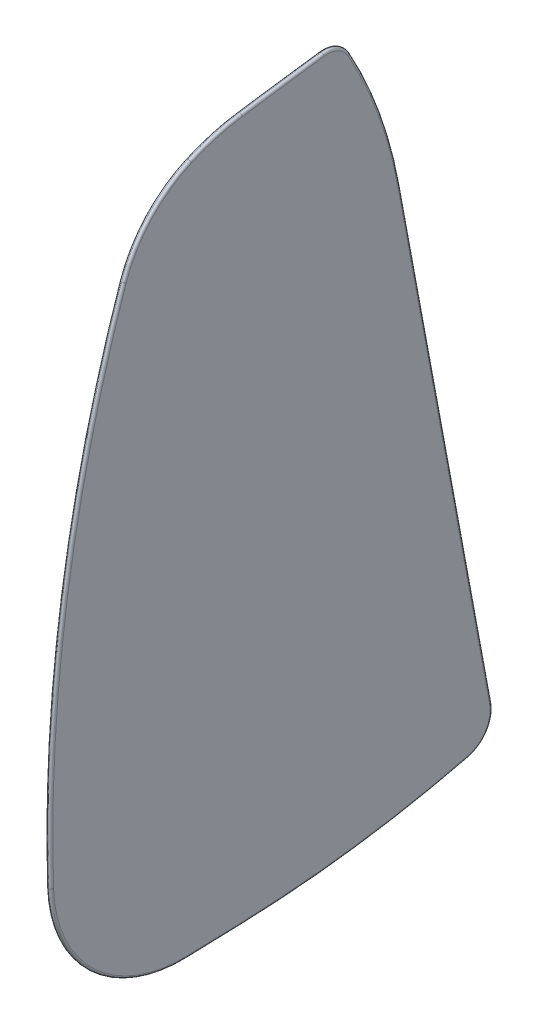
ISO-10303-21;
HEADER;
FILE_DESCRIPTION(('STEP AP214'),'2;1');
FILE_NAME('part.step','',(''),(''),'','','');
FILE_SCHEMA(('AUTOMOTIVE_DESIGN { 1 0 10303 214 1 1 1 1 }'));
ENDSEC;
DATA;
#1=APPLICATION_CONTEXT('core data for automotive mechanical design processes');
#2=APPLICATION_PROTOCOL_DEFINITION('international standard','automotive_design',2000,#1);
#3=PRODUCT_CONTEXT('',#1,'mechanical');
#4=PRODUCT('Part','Part','',(#3));
#5=PRODUCT_RELATED_PRODUCT_CATEGORY('part','',(#4));
#6=PRODUCT_DEFINITION_FORMATION('','',#4);
#7=PRODUCT_DEFINITION_CONTEXT('part definition',#1,'design');
#8=PRODUCT_DEFINITION('design','',#6,#7);
#9=PRODUCT_DEFINITION_SHAPE('','',#8);
#10=(LENGTH_UNIT() NAMED_UNIT(*) SI_UNIT(.MILLI.,.METRE.));
#11=(NAMED_UNIT(*) PLANE_ANGLE_UNIT() SI_UNIT($,.RADIAN.));
#12=(NAMED_UNIT(*) SI_UNIT($,.STERADIAN.) SOLID_ANGLE_UNIT());
#13=UNCERTAINTY_MEASURE_WITH_UNIT(LENGTH_MEASURE(1.E-05),#10,'distance_accuracy_value','');
#14=(GEOMETRIC_REPRESENTATION_CONTEXT(3) GLOBAL_UNCERTAINTY_ASSIGNED_CONTEXT((#13)) GLOBAL_UNIT_ASSIGNED_CONTEXT((#10,
#11,#12)) REPRESENTATION_CONTEXT('',''));
#15=CARTESIAN_POINT('',(0.,0.,0.));
#16=DIRECTION('',(0.,0.,1.));
#17=DIRECTION('',(1.,0.,0.));
#18=AXIS2_PLACEMENT_3D('',#15,#16,#17);
#19=CARTESIAN_POINT('',(1.5875,-2463.06089879731,-387.550646837047));
#20=DIRECTION('',(-1.,0.,0.));
#21=DIRECTION('',(0.,0.,1.));
#22=AXIS2_PLACEMENT_3D('',#19,#20,#21);
#23=PLANE('',#22);
#24=CARTESIAN_POINT('',(1.5875,165.367676868495,-9.10431464140729));
#25=DIRECTION('',(-1.,0.,0.));
#26=DIRECTION('',(0.,0.,1.));
#27=AXIS2_PLACEMENT_3D('',#24,#25,#26);
#28=CIRCLE('',#27,63.0906395932081);
#29=CARTESIAN_POINT('',(1.5875,227.814351787574,-0.113119179703479));
#30=VERTEX_POINT('',#29);
#31=CARTESIAN_POINT('',(1.5875,223.057286400209,16.4365889518184));
#32=VERTEX_POINT('',#31);
#33=EDGE_CURVE('E43',#30,#32,#28,.F.);
#34=ORIENTED_EDGE('',*,*,#33,.T.);
#35=CARTESIAN_POINT('',(1.5875,187.192136164159,0.558021702512013));
#36=DIRECTION('',(-1.,0.,0.));
#37=DIRECTION('',(0.,0.,1.));
#38=AXIS2_PLACEMENT_3D('',#35,#36,#37);
#39=CIRCLE('',#38,39.222925685693);
#40=CARTESIAN_POINT('',(1.5875,199.852299131577,37.6815745091042));
#41=VERTEX_POINT('',#40);
#42=EDGE_CURVE('E11',#32,#41,#39,.F.);
#43=ORIENTED_EDGE('',*,*,#42,.T.);
#44=CARTESIAN_POINT('',(1.5875,55.6857042225575,-385.059918851711));
#45=DIRECTION('',(-1.,0.,0.));
#46=DIRECTION('',(0.,0.,1.));
#47=AXIS2_PLACEMENT_3D('',#44,#45,#46);
#48=CIRCLE('',#47,446.647934391947);
#49=CARTESIAN_POINT('',(1.5875,40.9104577830131,61.3435638735519));
#50=VERTEX_POINT('',#49);
#51=EDGE_CURVE('E293',#41,#50,#48,.F.);
#52=ORIENTED_EDGE('',*,*,#51,.T.);
#53=CARTESIAN_POINT('',(1.5875,42.3031533449836,19.2661506968832));
#54=DIRECTION('',(-1.,0.,0.));
#55=DIRECTION('',(0.,0.,1.));
#56=AXIS2_PLACEMENT_3D('',#53,#54,#55);
#57=CIRCLE('',#56,42.1004548736683);
#58=CARTESIAN_POINT('',(1.5875,0.223974446046652,17.927866810317));
#59=VERTEX_POINT('',#58);
#60=EDGE_CURVE('E295',#50,#59,#57,.F.);
#61=ORIENTED_EDGE('',*,*,#60,.T.);
#62=DIRECTION('',(0.,0.0317878723776747,-0.999494637889419));
#63=VECTOR('',#62,1.);
#64=CARTESIAN_POINT('',(1.5875,10.6176873417101,-308.877909416845));
#65=LINE('',#64,#63);
#66=CARTESIAN_POINT('',(1.5875,0.793348868824694,0.025231623699778));
#67=VERTEX_POINT('',#66);
#68=EDGE_CURVE('E297',#59,#67,#65,.T.);
#69=ORIENTED_EDGE('',*,*,#68,.T.);
#70=CARTESIAN_POINT('',(1.5875,355.044088675088,11.29180262846));
#71=DIRECTION('',(-1.,0.,0.));
#72=DIRECTION('',(0.,0.,1.));
#73=AXIS2_PLACEMENT_3D('',#70,#71,#72);
#74=CIRCLE('',#73,354.429855225954);
#75=CARTESIAN_POINT('',(1.5875,10.9134874562677,-73.5294893934341));
#76=VERTEX_POINT('',#75);
#77=EDGE_CURVE('E299',#67,#76,#74,.F.);
#78=ORIENTED_EDGE('',*,*,#77,.T.);
#79=CARTESIAN_POINT('',(1.5875,20.1614266157411,-71.2500578483515));
#80=DIRECTION('',(-1.,0.,0.));
#81=DIRECTION('',(0.,0.,1.));
#82=AXIS2_PLACEMENT_3D('',#79,#80,#81);
#83=CIRCLE('',#82,9.52471452937241);
#84=CARTESIAN_POINT('',(1.5875,21.9008605829964,-80.6145950146826));
#85=VERTEX_POINT('',#84);
#86=EDGE_CURVE('E301',#76,#85,#83,.F.);
#87=ORIENTED_EDGE('',*,*,#86,.T.);
#88=DIRECTION('',(0.,0.983182974928292,0.182623212684351));
#89=VECTOR('',#88,1.);
#90=CARTESIAN_POINT('',(1.5875,-2435.29534047942,-537.031229432634));
#91=LINE('',#90,#89);
#92=CARTESIAN_POINT('',(1.5875,182.940602095311,-50.7019584914747));
#93=VERTEX_POINT('',#92);
#94=EDGE_CURVE('E303',#85,#93,#91,.T.);
#95=ORIENTED_EDGE('',*,*,#94,.T.);
#96=CARTESIAN_POINT('',(1.5875,156.06262125118,94.0002005493551));
#97=DIRECTION('',(-1.,0.,0.));
#98=DIRECTION('',(0.,0.,1.));
#99=AXIS2_PLACEMENT_3D('',#96,#97,#98);
#100=CIRCLE('',#99,147.177242416533);
#101=CARTESIAN_POINT('',(1.5875,227.56221835922,-34.6425151352997));
#102=VERTEX_POINT('',#101);
#103=EDGE_CURVE('E161',#93,#102,#100,.F.);
#104=ORIENTED_EDGE('',*,*,#103,.T.);
#105=CARTESIAN_POINT('',(1.5875,223.760356708439,-27.8021715921775));
#106=DIRECTION('',(-1.,0.,0.));
#107=DIRECTION('',(0.,0.,1.));
#108=AXIS2_PLACEMENT_3D('',#105,#106,#107);
#109=CIRCLE('',#108,7.82588345170112);
#110=CARTESIAN_POINT('',(1.5875,231.517020123578,-26.7636031236328));
#111=VERTEX_POINT('',#110);
#112=EDGE_CURVE('E155',#102,#111,#109,.F.);
#113=ORIENTED_EDGE('',*,*,#112,.T.);
#114=CARTESIAN_POINT('',(1.5875,-2463.06089879731,-387.550646837047));
#115=DIRECTION('',(-1.,0.,0.));
#116=DIRECTION('',(0.,0.,1.));
#117=AXIS2_PLACEMENT_3D('',#114,#115,#116);
#118=CIRCLE('',#117,2718.62418367223);
#119=EDGE_CURVE('E158',#111,#30,#118,.F.);
#120=ORIENTED_EDGE('',*,*,#119,.T.);
#121=EDGE_LOOP('',(#34,#43,#52,#61,#69,#78,#87,#95,#104,#113,#120));
#122=FACE_BOUND('',#121,.T.);
#123=ADVANCED_FACE('F33',(#122),#23,.F.);
#124=CARTESIAN_POINT('',(0.,-2463.06089879731,-387.550646837047));
#125=DIRECTION('',(-1.,0.,0.));
#126=DIRECTION('',(0.,0.,1.));
#127=AXIS2_PLACEMENT_3D('',#124,#125,#126);
#128=PLANE('',#127);
#129=CARTESIAN_POINT('',(0.,187.192136164159,0.558021702512013));
#130=DIRECTION('',(-1.,0.,0.));
#131=DIRECTION('',(0.,0.,1.));
#132=AXIS2_PLACEMENT_3D('',#129,#130,#131);
#133=CIRCLE('',#132,39.222925685693);
#134=CARTESIAN_POINT('',(0.,199.852299131576,37.6815745091041));
#135=VERTEX_POINT('',#134);
#136=CARTESIAN_POINT('',(0.,223.057286400211,16.4365889518193));
#137=VERTEX_POINT('',#136);
#138=EDGE_CURVE('E266',#135,#137,#133,.T.);
#139=ORIENTED_EDGE('',*,*,#138,.T.);
#140=CARTESIAN_POINT('',(0.,165.367676868495,-9.10431464140729));
#141=DIRECTION('',(-1.,0.,0.));
#142=DIRECTION('',(0.,0.,1.));
#143=AXIS2_PLACEMENT_3D('',#140,#141,#142);
#144=CIRCLE('',#143,63.0906395932081);
#145=CARTESIAN_POINT('',(0.,227.814351787574,-0.113119179703479));
#146=VERTEX_POINT('',#145);
#147=EDGE_CURVE('E291',#137,#146,#144,.T.);
#148=ORIENTED_EDGE('',*,*,#147,.T.);
#149=CARTESIAN_POINT('',(0.,-2463.06089879731,-387.550646837047));
#150=DIRECTION('',(-1.,0.,0.));
#151=DIRECTION('',(0.,0.,1.));
#152=AXIS2_PLACEMENT_3D('',#149,#150,#151);
#153=CIRCLE('',#152,2718.62418367223);
#154=CARTESIAN_POINT('',(0.,231.517020123578,-26.7636031236328));
#155=VERTEX_POINT('',#154);
#156=EDGE_CURVE('E289',#146,#155,#153,.T.);
#157=ORIENTED_EDGE('',*,*,#156,.T.);
#158=CARTESIAN_POINT('',(0.,223.760356708439,-27.8021715921775));
#159=DIRECTION('',(-1.,0.,0.));
#160=DIRECTION('',(0.,0.,1.));
#161=AXIS2_PLACEMENT_3D('',#158,#159,#160);
#162=CIRCLE('',#161,7.82588345170112);
#163=CARTESIAN_POINT('',(0.,227.56221835922,-34.6425151352997));
#164=VERTEX_POINT('',#163);
#165=EDGE_CURVE('E287',#155,#164,#162,.T.);
#166=ORIENTED_EDGE('',*,*,#165,.T.);
#167=CARTESIAN_POINT('',(0.,156.06262125118,94.0002005493551));
#168=DIRECTION('',(-1.,0.,0.));
#169=DIRECTION('',(0.,0.,1.));
#170=AXIS2_PLACEMENT_3D('',#167,#168,#169);
#171=CIRCLE('',#170,147.177242416533);
#172=CARTESIAN_POINT('',(0.,182.940602095311,-50.7019584914747));
#173=VERTEX_POINT('',#172);
#174=EDGE_CURVE('E285',#164,#173,#171,.T.);
#175=ORIENTED_EDGE('',*,*,#174,.T.);
#176=DIRECTION('',(0.,0.983182974928292,0.182623212684351));
#177=VECTOR('',#176,1.);
#178=CARTESIAN_POINT('',(0.,21.9008605829963,-80.6145950146826));
#179=LINE('',#178,#177);
#180=CARTESIAN_POINT('',(0.,21.9008605829964,-80.6145950146826));
#181=VERTEX_POINT('',#180);
#182=EDGE_CURVE('E283',#173,#181,#179,.F.);
#183=ORIENTED_EDGE('',*,*,#182,.T.);
#184=CARTESIAN_POINT('',(0.,20.1614266157411,-71.2500578483515));
#185=DIRECTION('',(-1.,0.,0.));
#186=DIRECTION('',(0.,0.,1.));
#187=AXIS2_PLACEMENT_3D('',#184,#185,#186);
#188=CIRCLE('',#187,9.52471452937241);
#189=CARTESIAN_POINT('',(0.,10.9134874562677,-73.5294893934341));
#190=VERTEX_POINT('',#189);
#191=EDGE_CURVE('E281',#181,#190,#188,.T.);
#192=ORIENTED_EDGE('',*,*,#191,.T.);
#193=CARTESIAN_POINT('',(0.,355.044088675088,11.29180262846));
#194=DIRECTION('',(-1.,0.,0.));
#195=DIRECTION('',(0.,0.,1.));
#196=AXIS2_PLACEMENT_3D('',#193,#194,#195);
#197=CIRCLE('',#196,354.429855225954);
#198=CARTESIAN_POINT('',(0.,0.793348868824726,0.025231623699779));
#199=VERTEX_POINT('',#198);
#200=EDGE_CURVE('E279',#190,#199,#197,.T.);
#201=ORIENTED_EDGE('',*,*,#200,.T.);
#202=DIRECTION('',(0.,0.0317878723776747,-0.999494637889419));
#203=VECTOR('',#202,1.);
#204=CARTESIAN_POINT('',(0.,0.223974446028472,17.9278668103165));
#205=LINE('',#204,#203);
#206=CARTESIAN_POINT('',(0.,0.22397444604665,17.927866810317));
#207=VERTEX_POINT('',#206);
#208=EDGE_CURVE('E277',#199,#207,#205,.F.);
#209=ORIENTED_EDGE('',*,*,#208,.T.);
#210=CARTESIAN_POINT('',(0.,42.3031533449836,19.2661506968832));
#211=DIRECTION('',(-1.,0.,0.));
#212=DIRECTION('',(0.,0.,1.));
#213=AXIS2_PLACEMENT_3D('',#210,#211,#212);
#214=CIRCLE('',#213,42.1004548736683);
#215=CARTESIAN_POINT('',(0.,40.9104577830131,61.3435638735519));
#216=VERTEX_POINT('',#215);
#217=EDGE_CURVE('E273',#207,#216,#214,.T.);
#218=ORIENTED_EDGE('',*,*,#217,.T.);
#219=CARTESIAN_POINT('',(0.,55.6857042225575,-385.059918851711));
#220=DIRECTION('',(-1.,0.,0.));
#221=DIRECTION('',(0.,0.,1.));
#222=AXIS2_PLACEMENT_3D('',#219,#220,#221);
#223=CIRCLE('',#222,446.647934391947);
#224=EDGE_CURVE('E100',#216,#135,#223,.T.);
#225=ORIENTED_EDGE('',*,*,#224,.T.);
#226=EDGE_LOOP('',(#139,#148,#157,#166,#175,#183,#192,#201,#209,#218,#225));
#227=FACE_BOUND('',#226,.T.);
#228=ADVANCED_FACE('F361',(#227),#128,.T.);
#229=CARTESIAN_POINT('',(0.79375,20.1614266157411,-71.2500578483515));
#230=DIRECTION('',(-1.,0.,0.));
#231=DIRECTION('',(0.,0.,1.));
#232=AXIS2_PLACEMENT_3D('',#229,#230,#231);
#233=TOROIDAL_SURFACE('',#232,9.52471452937241,0.79375);
#234=CARTESIAN_POINT('',(0.79375,21.9008605829964,-80.6145950146826));
#235=DIRECTION('',(0.,0.983182974928292,0.18262321268435));
#236=DIRECTION('',(0.,-0.18262321268435,0.983182974928292));
#237=AXIS2_PLACEMENT_3D('',#234,#235,#236);
#238=CIRCLE('',#237,0.79375);
#239=CARTESIAN_POINT('',(0.79375,22.0458177580646,-81.3949965010319));
#240=VERTEX_POINT('',#239);
#241=EDGE_CURVE('E261',#85,#240,#238,.T.);
#242=ORIENTED_EDGE('',*,*,#241,.F.);
#243=ORIENTED_EDGE('',*,*,#86,.F.);
#244=CARTESIAN_POINT('',(0.79375,10.9134874562677,-73.5294893934341));
#245=DIRECTION('',(0.,-0.23931757094171,0.970941347476025));
#246=DIRECTION('',(0.,-0.970941347476025,-0.23931757094171));
#247=AXIS2_PLACEMENT_3D('',#244,#245,#246);
#248=CIRCLE('',#247,0.79375);
#249=CARTESIAN_POINT('',(0.79375,10.1428027617086,-73.7194477153691));
#250=VERTEX_POINT('',#249);
#251=EDGE_CURVE('E37',#250,#76,#248,.T.);
#252=ORIENTED_EDGE('',*,*,#251,.F.);
#253=CARTESIAN_POINT('',(0.79375,20.1614266157411,-71.2500578483515));
#254=DIRECTION('',(-1.,0.,0.));
#255=DIRECTION('',(0.,0.,1.));
#256=AXIS2_PLACEMENT_3D('',#253,#254,#255);
#257=CIRCLE('',#256,10.3184645293724);
#258=EDGE_CURVE('E88',#240,#250,#257,.T.);
#259=ORIENTED_EDGE('',*,*,#258,.F.);
#260=EDGE_LOOP('',(#242,#243,#252,#259));
#261=FACE_BOUND('',#260,.T.);
#262=ADVANCED_FACE('F35',(#261),#233,.T.);
#263=CARTESIAN_POINT('',(0.79375,355.044088675088,11.29180262846));
#264=DIRECTION('',(-1.,0.,0.));
#265=DIRECTION('',(0.,0.,1.));
#266=AXIS2_PLACEMENT_3D('',#263,#264,#265);
#267=TOROIDAL_SURFACE('',#266,354.429855225954,0.79375);
#268=ORIENTED_EDGE('',*,*,#251,.T.);
#269=ORIENTED_EDGE('',*,*,#77,.F.);
#270=CARTESIAN_POINT('',(0.79375,0.793348868824726,0.025231623699779));
#271=DIRECTION('',(0.,-0.0317878723776744,0.999494637889419));
#272=DIRECTION('',(0.,-0.999494637889419,-0.0317878723776744));
#273=AXIS2_PLACEMENT_3D('',#270,#271,#272);
#274=CIRCLE('',#273,0.79375);
#275=CARTESIAN_POINT('',(0.79375,0.,0.));
#276=VERTEX_POINT('',#275);
#277=EDGE_CURVE('E258',#276,#67,#274,.T.);
#278=ORIENTED_EDGE('',*,*,#277,.F.);
#279=CARTESIAN_POINT('',(0.79375,355.044088675088,11.29180262846));
#280=DIRECTION('',(-1.,0.,0.));
#281=DIRECTION('',(0.,0.,1.));
#282=AXIS2_PLACEMENT_3D('',#279,#280,#281);
#283=CIRCLE('',#282,355.223605225954);
#284=EDGE_CURVE('E255',#250,#276,#283,.T.);
#285=ORIENTED_EDGE('',*,*,#284,.F.);
#286=EDGE_LOOP('',(#268,#269,#278,#285));
#287=FACE_BOUND('',#286,.T.);
#288=ADVANCED_FACE('F355',(#287),#267,.T.);
#289=CARTESIAN_POINT('',(0.79375,20.1614266157411,-71.2500578483515));
#290=DIRECTION('',(-1.,0.,0.));
#291=DIRECTION('',(0.,0.,1.));
#292=AXIS2_PLACEMENT_3D('',#289,#290,#291);
#293=TOROIDAL_SURFACE('',#292,9.52471452937241,0.79375);
#294=CARTESIAN_POINT('',(0.79375,21.9008605829964,-80.6145950146826));
#295=DIRECTION('',(0.,0.983182974928292,0.182623212684351));
#296=DIRECTION('',(0.,-0.182623212684351,0.983182974928292));
#297=AXIS2_PLACEMENT_3D('',#294,#295,#296);
#298=CIRCLE('',#297,0.79375);
#299=EDGE_CURVE('E249',#240,#181,#298,.T.);
#300=ORIENTED_EDGE('',*,*,#299,.F.);
#301=ORIENTED_EDGE('',*,*,#258,.T.);
#302=CARTESIAN_POINT('',(0.79375,10.9134874562677,-73.5294893934341));
#303=DIRECTION('',(0.,-0.23931757094171,0.970941347476025));
#304=DIRECTION('',(0.,-0.970941347476025,-0.23931757094171));
#305=AXIS2_PLACEMENT_3D('',#302,#303,#304);
#306=CIRCLE('',#305,0.79375);
#307=EDGE_CURVE('E252',#190,#250,#306,.T.);
#308=ORIENTED_EDGE('',*,*,#307,.F.);
#309=ORIENTED_EDGE('',*,*,#191,.F.);
#310=EDGE_LOOP('',(#300,#301,#308,#309));
#311=FACE_BOUND('',#310,.T.);
#312=ADVANCED_FACE('F357',(#311),#293,.T.);
#313=CARTESIAN_POINT('',(0.79375,-2435.29534047942,-537.031229432634));
#314=DIRECTION('',(0.,0.983182974928292,0.182623212684351));
#315=DIRECTION('',(0.,-0.182623212684351,0.983182974928292));
#316=AXIS2_PLACEMENT_3D('',#313,#314,#315);
#317=CYLINDRICAL_SURFACE('',#316,0.79375);
#318=ORIENTED_EDGE('',*,*,#94,.F.);
#319=ORIENTED_EDGE('',*,*,#241,.T.);
#320=DIRECTION('',(0.,0.983182974928292,0.182623212684351));
#321=VECTOR('',#320,1.);
#322=CARTESIAN_POINT('',(0.79375,183.085559270379,-51.482359977824));
#323=LINE('',#322,#321);
#324=CARTESIAN_POINT('',(0.79375,183.085559270379,-51.482359977824));
#325=VERTEX_POINT('',#324);
#326=EDGE_CURVE('E246',#325,#240,#323,.F.);
#327=ORIENTED_EDGE('',*,*,#326,.F.);
#328=CARTESIAN_POINT('',(0.79375,182.940602095311,-50.7019584914747));
#329=DIRECTION('',(0.,0.983182974928291,0.182623212684356));
#330=DIRECTION('',(0.,-0.182623212684356,0.983182974928291));
#331=AXIS2_PLACEMENT_3D('',#328,#329,#330);
#332=CIRCLE('',#331,0.79375);
#333=EDGE_CURVE('E243',#93,#325,#332,.T.);
#334=ORIENTED_EDGE('',*,*,#333,.F.);
#335=EDGE_LOOP('',(#318,#319,#327,#334));
#336=FACE_BOUND('',#335,.T.);
#337=ADVANCED_FACE('F307',(#336),#317,.T.);
#338=CARTESIAN_POINT('',(0.79375,10.6176873417101,-308.877909416845));
#339=DIRECTION('',(0.,0.0317878723776747,-0.999494637889419));
#340=DIRECTION('',(0.,0.999494637889419,0.0317878723776747));
#341=AXIS2_PLACEMENT_3D('',#338,#339,#340);
#342=CYLINDRICAL_SURFACE('',#341,0.79375);
#343=ORIENTED_EDGE('',*,*,#277,.T.);
#344=ORIENTED_EDGE('',*,*,#68,.F.);
#345=CARTESIAN_POINT('',(0.79375,0.223974446028472,17.9278668103165));
#346=DIRECTION('',(0.,-0.0317878723776754,0.999494637889419));
#347=DIRECTION('',(0.,-0.999494637889419,-0.0317878723776754));
#348=AXIS2_PLACEMENT_3D('',#345,#346,#347);
#349=CIRCLE('',#348,0.79375);
#350=CARTESIAN_POINT('',(0.79375,-0.569374422778077,17.9026351866173));
#351=VERTEX_POINT('',#350);
#352=EDGE_CURVE('E240',#351,#59,#349,.T.);
#353=ORIENTED_EDGE('',*,*,#352,.F.);
#354=DIRECTION('',(0.,0.0317878723776747,-0.999494637889419));
#355=VECTOR('',#354,1.);
#356=CARTESIAN_POINT('',(0.79375,-0.569374422796254,17.9026351866167));
#357=LINE('',#356,#355);
#358=EDGE_CURVE('E237',#276,#351,#357,.F.);
#359=ORIENTED_EDGE('',*,*,#358,.F.);
#360=EDGE_LOOP('',(#343,#344,#353,#359));
#361=FACE_BOUND('',#360,.T.);
#362=ADVANCED_FACE('F345',(#361),#342,.T.);
#363=CARTESIAN_POINT('',(0.79375,355.044088675088,11.29180262846));
#364=DIRECTION('',(-1.,0.,0.));
#365=DIRECTION('',(0.,0.,1.));
#366=AXIS2_PLACEMENT_3D('',#363,#364,#365);
#367=TOROIDAL_SURFACE('',#366,354.429855225954,0.79375);
#368=ORIENTED_EDGE('',*,*,#307,.T.);
#369=ORIENTED_EDGE('',*,*,#284,.T.);
#370=CARTESIAN_POINT('',(0.79375,0.793348868824726,0.025231623699779));
#371=DIRECTION('',(0.,-0.0317878723776744,0.999494637889419));
#372=DIRECTION('',(0.,-0.999494637889419,-0.0317878723776744));
#373=AXIS2_PLACEMENT_3D('',#370,#371,#372);
#374=CIRCLE('',#373,0.79375);
#375=EDGE_CURVE('E234',#199,#276,#374,.T.);
#376=ORIENTED_EDGE('',*,*,#375,.F.);
#377=ORIENTED_EDGE('',*,*,#200,.F.);
#378=EDGE_LOOP('',(#368,#369,#376,#377));
#379=FACE_BOUND('',#378,.T.);
#380=ADVANCED_FACE('F354',(#379),#367,.T.);
#381=CARTESIAN_POINT('',(0.79375,182.940602095311,-50.7019584914747));
#382=DIRECTION('',(0.,-0.983182974928292,-0.182623212684351));
#383=DIRECTION('',(0.,0.182623212684351,-0.983182974928292));
#384=AXIS2_PLACEMENT_3D('',#381,#382,#383);
#385=CYLINDRICAL_SURFACE('',#384,0.79375);
#386=ORIENTED_EDGE('',*,*,#299,.T.);
#387=ORIENTED_EDGE('',*,*,#182,.F.);
#388=CARTESIAN_POINT('',(0.79375,182.940602095311,-50.7019584914747));
#389=DIRECTION('',(0.,0.98318297492829,0.182623212684361));
#390=DIRECTION('',(0.,-0.182623212684361,0.98318297492829));
#391=AXIS2_PLACEMENT_3D('',#388,#389,#390);
#392=CIRCLE('',#391,0.79375);
#393=EDGE_CURVE('E231',#325,#173,#392,.T.);
#394=ORIENTED_EDGE('',*,*,#393,.F.);
#395=ORIENTED_EDGE('',*,*,#326,.T.);
#396=EDGE_LOOP('',(#386,#387,#394,#395));
#397=FACE_BOUND('',#396,.T.);
#398=ADVANCED_FACE('F360',(#397),#385,.T.);
#399=CARTESIAN_POINT('',(0.79375,156.06262125118,94.0002005493551));
#400=DIRECTION('',(-1.,0.,0.));
#401=DIRECTION('',(0.,0.,1.));
#402=AXIS2_PLACEMENT_3D('',#399,#400,#401);
#403=TOROIDAL_SURFACE('',#402,147.177242416533,0.79375);
#404=ORIENTED_EDGE('',*,*,#103,.F.);
#405=ORIENTED_EDGE('',*,*,#333,.T.);
#406=CARTESIAN_POINT('',(0.79375,156.06262125118,94.0002005493551));
#407=DIRECTION('',(-1.,0.,0.));
#408=DIRECTION('',(0.,0.,1.));
#409=AXIS2_PLACEMENT_3D('',#406,#407,#408);
#410=CIRCLE('',#409,147.970992416533);
#411=CARTESIAN_POINT('',(0.79375,227.947826923918,-35.336305519588));
#412=VERTEX_POINT('',#411);
#413=EDGE_CURVE('E228',#412,#325,#410,.T.);
#414=ORIENTED_EDGE('',*,*,#413,.F.);
#415=CARTESIAN_POINT('',(0.79375,227.56221835922,-34.6425151352997));
#416=DIRECTION('',(0.,0.874066625875325,0.485806065761765));
#417=DIRECTION('',(0.,-0.485806065761766,0.874066625875325));
#418=AXIS2_PLACEMENT_3D('',#415,#416,#417);
#419=CIRCLE('',#418,0.79375);
#420=EDGE_CURVE('E226',#102,#412,#419,.T.);
#421=ORIENTED_EDGE('',*,*,#420,.F.);
#422=EDGE_LOOP('',(#404,#405,#414,#421));
#423=FACE_BOUND('',#422,.T.);
#424=ADVANCED_FACE('F310',(#423),#403,.T.);
#425=CARTESIAN_POINT('',(0.79375,42.3031533449836,19.2661506968832));
#426=DIRECTION('',(-1.,0.,0.));
#427=DIRECTION('',(0.,0.,1.));
#428=AXIS2_PLACEMENT_3D('',#425,#426,#427);
#429=TOROIDAL_SURFACE('',#428,42.1004548736683,0.79375);
#430=ORIENTED_EDGE('',*,*,#352,.T.);
#431=ORIENTED_EDGE('',*,*,#60,.F.);
#432=CARTESIAN_POINT('',(0.79375,40.9104577830125,61.3435638735681));
#433=DIRECTION('',(0.,0.99945269719644,0.0330802972592622));
#434=DIRECTION('',(0.,-0.0330802972592622,0.99945269719644));
#435=AXIS2_PLACEMENT_3D('',#432,#433,#434);
#436=CIRCLE('',#435,0.79375);
#437=CARTESIAN_POINT('',(0.79375,40.8842002970635,62.1368794519516));
#438=VERTEX_POINT('',#437);
#439=EDGE_CURVE('E223',#438,#50,#436,.T.);
#440=ORIENTED_EDGE('',*,*,#439,.F.);
#441=CARTESIAN_POINT('',(0.79375,42.3031533449836,19.2661506968832));
#442=DIRECTION('',(-1.,0.,0.));
#443=DIRECTION('',(0.,0.,1.));
#444=AXIS2_PLACEMENT_3D('',#441,#442,#443);
#445=CIRCLE('',#444,42.8942048736683);
#446=EDGE_CURVE('E220',#351,#438,#445,.T.);
#447=ORIENTED_EDGE('',*,*,#446,.F.);
#448=EDGE_LOOP('',(#430,#431,#440,#447));
#449=FACE_BOUND('',#448,.T.);
#450=ADVANCED_FACE('F341',(#449),#429,.T.);
#451=CARTESIAN_POINT('',(0.79375,0.223974446028472,17.9278668103164));
#452=DIRECTION('',(0.,-0.0317878723776747,0.999494637889419));
#453=DIRECTION('',(0.,-0.999494637889419,-0.0317878723776747));
#454=AXIS2_PLACEMENT_3D('',#451,#452,#453);
#455=CYLINDRICAL_SURFACE('',#454,0.79375);
#456=ORIENTED_EDGE('',*,*,#375,.T.);
#457=ORIENTED_EDGE('',*,*,#358,.T.);
#458=CARTESIAN_POINT('',(0.79375,0.223974446028472,17.9278668103165));
#459=DIRECTION('',(0.,-0.0317878723776754,0.999494637889419));
#460=DIRECTION('',(0.,-0.999494637889419,-0.0317878723776754));
#461=AXIS2_PLACEMENT_3D('',#458,#459,#460);
#462=CIRCLE('',#461,0.79375);
#463=EDGE_CURVE('E217',#207,#351,#462,.T.);
#464=ORIENTED_EDGE('',*,*,#463,.F.);
#465=ORIENTED_EDGE('',*,*,#208,.F.);
#466=EDGE_LOOP('',(#456,#457,#464,#465));
#467=FACE_BOUND('',#466,.T.);
#468=ADVANCED_FACE('F348',(#467),#455,.T.);
#469=CARTESIAN_POINT('',(0.79375,156.06262125118,94.0002005493551));
#470=DIRECTION('',(-1.,0.,0.));
#471=DIRECTION('',(0.,0.,1.));
#472=AXIS2_PLACEMENT_3D('',#469,#470,#471);
#473=TOROIDAL_SURFACE('',#472,147.177242416533,0.79375);
#474=ORIENTED_EDGE('',*,*,#393,.T.);
#475=ORIENTED_EDGE('',*,*,#174,.F.);
#476=CARTESIAN_POINT('',(0.79375,227.56221835922,-34.6425151352997));
#477=DIRECTION('',(0.,0.874066625875323,0.485806065761769));
#478=DIRECTION('',(0.,-0.485806065761769,0.874066625875323));
#479=AXIS2_PLACEMENT_3D('',#476,#477,#478);
#480=CIRCLE('',#479,0.79375);
#481=EDGE_CURVE('E214',#412,#164,#480,.T.);
#482=ORIENTED_EDGE('',*,*,#481,.F.);
#483=ORIENTED_EDGE('',*,*,#413,.T.);
#484=EDGE_LOOP('',(#474,#475,#482,#483));
#485=FACE_BOUND('',#484,.T.);
#486=ADVANCED_FACE('F314',(#485),#473,.T.);
#487=CARTESIAN_POINT('',(0.79375,223.760356708439,-27.8021715921775));
#488=DIRECTION('',(-1.,0.,0.));
#489=DIRECTION('',(0.,0.,1.));
#490=AXIS2_PLACEMENT_3D('',#487,#488,#489);
#491=TOROIDAL_SURFACE('',#490,7.82588345170112,0.79375);
#492=ORIENTED_EDGE('',*,*,#112,.F.);
#493=ORIENTED_EDGE('',*,*,#420,.T.);
#494=CARTESIAN_POINT('',(0.79375,223.760356708439,-27.8021715921775));
#495=DIRECTION('',(-1.,0.,0.));
#496=DIRECTION('',(0.,0.,1.));
#497=AXIS2_PLACEMENT_3D('',#494,#495,#496);
#498=CIRCLE('',#497,8.61963345170112);
#499=CARTESIAN_POINT('',(0.79375,232.303749394948,-26.6582650200185));
#500=VERTEX_POINT('',#499);
#501=EDGE_CURVE('E170',#500,#412,#498,.T.);
#502=ORIENTED_EDGE('',*,*,#501,.F.);
#503=CARTESIAN_POINT('',(0.79375,231.517020123578,-26.7636031236328));
#504=DIRECTION('',(0.,-0.13270942187606,0.991154987550041));
#505=DIRECTION('',(0.,-0.991154987550041,-0.13270942187606));
#506=AXIS2_PLACEMENT_3D('',#503,#504,#505);
#507=CIRCLE('',#506,0.79375);
#508=EDGE_CURVE('E167',#111,#500,#507,.T.);
#509=ORIENTED_EDGE('',*,*,#508,.F.);
#510=EDGE_LOOP('',(#492,#493,#502,#509));
#511=FACE_BOUND('',#510,.T.);
#512=ADVANCED_FACE('F168',(#511),#491,.T.);
#513=CARTESIAN_POINT('',(0.79375,55.6857042225575,-385.059918851711));
#514=DIRECTION('',(-1.,0.,0.));
#515=DIRECTION('',(0.,0.,1.));
#516=AXIS2_PLACEMENT_3D('',#513,#514,#515);
#517=TOROIDAL_SURFACE('',#516,446.647934391947,0.79375);
#518=ORIENTED_EDGE('',*,*,#439,.T.);
#519=ORIENTED_EDGE('',*,*,#51,.F.);
#520=CARTESIAN_POINT('',(0.79375,199.852299131576,37.6815745091044));
#521=DIRECTION('',(-8.09941259274367E-13,0.946475872403441,-0.322774569875237));
#522=DIRECTION('',(0.,0.322774569875237,0.946475872403442));
#523=AXIS2_PLACEMENT_3D('',#520,#521,#522);
#524=CIRCLE('',#523,0.79375);
#525=CARTESIAN_POINT('',(0.79375,200.108501446414,38.4328397328243));
#526=VERTEX_POINT('',#525);
#527=EDGE_CURVE('E173',#526,#41,#524,.T.);
#528=ORIENTED_EDGE('',*,*,#527,.F.);
#529=CARTESIAN_POINT('',(0.79375,55.6857042225575,-385.059918851711));
#530=DIRECTION('',(-1.,0.,0.));
#531=DIRECTION('',(0.,0.,1.));
#532=AXIS2_PLACEMENT_3D('',#529,#530,#531);
#533=CIRCLE('',#532,447.441684391947);
#534=EDGE_CURVE('E209',#438,#526,#533,.T.);
#535=ORIENTED_EDGE('',*,*,#534,.F.);
#536=EDGE_LOOP('',(#518,#519,#528,#535));
#537=FACE_BOUND('',#536,.T.);
#538=ADVANCED_FACE('F336',(#537),#517,.T.);
#539=CARTESIAN_POINT('',(0.79375,42.3031533449836,19.2661506968832));
#540=DIRECTION('',(-1.,0.,0.));
#541=DIRECTION('',(0.,0.,1.));
#542=AXIS2_PLACEMENT_3D('',#539,#540,#541);
#543=TOROIDAL_SURFACE('',#542,42.1004548736683,0.79375);
#544=ORIENTED_EDGE('',*,*,#463,.T.);
#545=ORIENTED_EDGE('',*,*,#446,.T.);
#546=CARTESIAN_POINT('',(0.79375,40.9104577830125,61.3435638735681));
#547=DIRECTION('',(0.,0.99945269719644,0.033080297259262));
#548=DIRECTION('',(0.,-0.033080297259262,0.99945269719644));
#549=AXIS2_PLACEMENT_3D('',#546,#547,#548);
#550=CIRCLE('',#549,0.79375);
#551=EDGE_CURVE('E206',#216,#438,#550,.T.);
#552=ORIENTED_EDGE('',*,*,#551,.F.);
#553=ORIENTED_EDGE('',*,*,#217,.F.);
#554=EDGE_LOOP('',(#544,#545,#552,#553));
#555=FACE_BOUND('',#554,.T.);
#556=ADVANCED_FACE('F407',(#555),#543,.T.);
#557=CARTESIAN_POINT('',(0.79375,223.760356708439,-27.8021715921775));
#558=DIRECTION('',(-1.,0.,0.));
#559=DIRECTION('',(0.,0.,1.));
#560=AXIS2_PLACEMENT_3D('',#557,#558,#559);
#561=TOROIDAL_SURFACE('',#560,7.82588345170112,0.79375);
#562=ORIENTED_EDGE('',*,*,#481,.T.);
#563=ORIENTED_EDGE('',*,*,#165,.F.);
#564=CARTESIAN_POINT('',(0.79375,231.517020123578,-26.7636031236328));
#565=DIRECTION('',(0.,-0.132709421876055,0.991154987550042));
#566=DIRECTION('',(0.,-0.991154987550042,-0.132709421876055));
#567=AXIS2_PLACEMENT_3D('',#564,#565,#566);
#568=CIRCLE('',#567,0.79375);
#569=EDGE_CURVE('E203',#500,#155,#568,.T.);
#570=ORIENTED_EDGE('',*,*,#569,.F.);
#571=ORIENTED_EDGE('',*,*,#501,.T.);
#572=EDGE_LOOP('',(#562,#563,#570,#571));
#573=FACE_BOUND('',#572,.T.);
#574=ADVANCED_FACE('F317',(#573),#561,.T.);
#575=CARTESIAN_POINT('',(0.79375,-2463.06089879731,-387.550646837047));
#576=DIRECTION('',(-1.,0.,0.));
#577=DIRECTION('',(0.,0.,1.));
#578=AXIS2_PLACEMENT_3D('',#575,#576,#577);
#579=TOROIDAL_SURFACE('',#578,2718.62418367223,0.79375);
#580=ORIENTED_EDGE('',*,*,#119,.F.);
#581=ORIENTED_EDGE('',*,*,#508,.T.);
#582=CARTESIAN_POINT('',(0.79375,-2463.06089879731,-387.550646837047));
#583=DIRECTION('',(-1.,0.,0.));
#584=DIRECTION('',(0.,0.,1.));
#585=AXIS2_PLACEMENT_3D('',#582,#583,#584);
#586=CIRCLE('',#585,2719.41793367223);
#587=CARTESIAN_POINT('',(0.79375,228.6,0.));
#588=VERTEX_POINT('',#587);
#589=EDGE_CURVE('E200',#588,#500,#586,.T.);
#590=ORIENTED_EDGE('',*,*,#589,.F.);
#591=CARTESIAN_POINT('',(0.79375,227.814351787574,-0.113119179703479));
#592=DIRECTION('',(0.,-0.142512352381858,0.989793023524913));
#593=DIRECTION('',(0.,-0.989793023524913,-0.142512352381858));
#594=AXIS2_PLACEMENT_3D('',#591,#592,#593);
#595=CIRCLE('',#594,0.79375);
#596=EDGE_CURVE('E177',#30,#588,#595,.T.);
#597=ORIENTED_EDGE('',*,*,#596,.F.);
#598=EDGE_LOOP('',(#580,#581,#590,#597));
#599=FACE_BOUND('',#598,.T.);
#600=ADVANCED_FACE('F175',(#599),#579,.T.);
#601=CARTESIAN_POINT('',(0.79375,187.192136164159,0.558021702512013));
#602=DIRECTION('',(-1.,0.,0.));
#603=DIRECTION('',(0.,0.,1.));
#604=AXIS2_PLACEMENT_3D('',#601,#602,#603);
#605=TOROIDAL_SURFACE('',#604,39.222925685693,0.79375);
#606=ORIENTED_EDGE('',*,*,#527,.T.);
#607=ORIENTED_EDGE('',*,*,#42,.F.);
#608=CARTESIAN_POINT('',(0.79375,223.057286400211,16.4365889518193));
#609=DIRECTION('',(0.,0.404828731455363,-0.914392529599975));
#610=DIRECTION('',(0.,0.914392529599975,0.404828731455363));
#611=AXIS2_PLACEMENT_3D('',#608,#609,#610);
#612=CIRCLE('',#611,0.79375);
#613=CARTESIAN_POINT('',(0.79375,223.783085470579,16.757921757411));
#614=VERTEX_POINT('',#613);
#615=EDGE_CURVE('E196',#614,#32,#612,.T.);
#616=ORIENTED_EDGE('',*,*,#615,.F.);
#617=CARTESIAN_POINT('',(0.79375,187.192136164159,0.558021702512013));
#618=DIRECTION('',(-1.,0.,0.));
#619=DIRECTION('',(0.,0.,1.));
#620=AXIS2_PLACEMENT_3D('',#617,#618,#619);
#621=CIRCLE('',#620,40.016675685693);
#622=EDGE_CURVE('E193',#526,#614,#621,.T.);
#623=ORIENTED_EDGE('',*,*,#622,.F.);
#624=EDGE_LOOP('',(#606,#607,#616,#623));
#625=FACE_BOUND('',#624,.T.);
#626=ADVANCED_FACE('F327',(#625),#605,.T.);
#627=CARTESIAN_POINT('',(0.79375,55.6857042225575,-385.059918851711));
#628=DIRECTION('',(-1.,0.,0.));
#629=DIRECTION('',(0.,0.,1.));
#630=AXIS2_PLACEMENT_3D('',#627,#628,#629);
#631=TOROIDAL_SURFACE('',#630,446.647934391947,0.79375);
#632=ORIENTED_EDGE('',*,*,#551,.T.);
#633=ORIENTED_EDGE('',*,*,#534,.T.);
#634=CARTESIAN_POINT('',(0.79375,199.852299131576,37.6815745091044));
#635=DIRECTION('',(0.,0.946475872403441,-0.322774569875237));
#636=DIRECTION('',(0.,0.322774569875237,0.946475872403442));
#637=AXIS2_PLACEMENT_3D('',#634,#635,#636);
#638=CIRCLE('',#637,0.79375);
#639=EDGE_CURVE('E190',#135,#526,#638,.T.);
#640=ORIENTED_EDGE('',*,*,#639,.F.);
#641=ORIENTED_EDGE('',*,*,#224,.F.);
#642=EDGE_LOOP('',(#632,#633,#640,#641));
#643=FACE_BOUND('',#642,.T.);
#644=ADVANCED_FACE('F332',(#643),#631,.T.);
#645=CARTESIAN_POINT('',(0.79375,-2463.06089879731,-387.550646837047));
#646=DIRECTION('',(-1.,0.,0.));
#647=DIRECTION('',(0.,0.,1.));
#648=AXIS2_PLACEMENT_3D('',#645,#646,#647);
#649=TOROIDAL_SURFACE('',#648,2718.62418367223,0.79375);
#650=ORIENTED_EDGE('',*,*,#569,.T.);
#651=ORIENTED_EDGE('',*,*,#156,.F.);
#652=CARTESIAN_POINT('',(0.79375,227.814351787574,-0.113119179703483));
#653=DIRECTION('',(0.,-0.142512352381857,0.989793023524913));
#654=DIRECTION('',(0.,-0.989793023524913,-0.142512352381857));
#655=AXIS2_PLACEMENT_3D('',#652,#653,#654);
#656=CIRCLE('',#655,0.79375);
#657=EDGE_CURVE('E188',#588,#146,#656,.T.);
#658=ORIENTED_EDGE('',*,*,#657,.F.);
#659=ORIENTED_EDGE('',*,*,#589,.T.);
#660=EDGE_LOOP('',(#650,#651,#658,#659));
#661=FACE_BOUND('',#660,.T.);
#662=ADVANCED_FACE('F321',(#661),#649,.T.);
#663=CARTESIAN_POINT('',(0.79375,165.367676868495,-9.10431464140729));
#664=DIRECTION('',(-1.,0.,0.));
#665=DIRECTION('',(0.,0.,1.));
#666=AXIS2_PLACEMENT_3D('',#663,#664,#665);
#667=TOROIDAL_SURFACE('',#666,63.0906395932081,0.79375);
#668=ORIENTED_EDGE('',*,*,#33,.F.);
#669=ORIENTED_EDGE('',*,*,#596,.T.);
#670=CARTESIAN_POINT('',(0.79375,165.367676868495,-9.10431464140729));
#671=DIRECTION('',(-1.,0.,0.));
#672=DIRECTION('',(0.,0.,1.));
#673=AXIS2_PLACEMENT_3D('',#670,#671,#672);
#674=CIRCLE('',#673,63.8843895932081);
#675=EDGE_CURVE('E185',#614,#588,#674,.T.);
#676=ORIENTED_EDGE('',*,*,#675,.F.);
#677=ORIENTED_EDGE('',*,*,#615,.T.);
#678=EDGE_LOOP('',(#668,#669,#676,#677));
#679=FACE_BOUND('',#678,.T.);
#680=ADVANCED_FACE('F324',(#679),#667,.T.);
#681=CARTESIAN_POINT('',(0.79375,187.192136164159,0.558021702512013));
#682=DIRECTION('',(-1.,0.,0.));
#683=DIRECTION('',(0.,0.,1.));
#684=AXIS2_PLACEMENT_3D('',#681,#682,#683);
#685=TOROIDAL_SURFACE('',#684,39.222925685693,0.79375);
#686=ORIENTED_EDGE('',*,*,#639,.T.);
#687=ORIENTED_EDGE('',*,*,#622,.T.);
#688=CARTESIAN_POINT('',(0.79375,223.057286400211,16.4365889518193));
#689=DIRECTION('',(0.,0.404828731455348,-0.914392529599982));
#690=DIRECTION('',(0.,0.914392529599982,0.404828731455348));
#691=AXIS2_PLACEMENT_3D('',#688,#689,#690);
#692=CIRCLE('',#691,0.79375);
#693=EDGE_CURVE('E182',#137,#614,#692,.T.);
#694=ORIENTED_EDGE('',*,*,#693,.F.);
#695=ORIENTED_EDGE('',*,*,#138,.F.);
#696=EDGE_LOOP('',(#686,#687,#694,#695));
#697=FACE_BOUND('',#696,.T.);
#698=ADVANCED_FACE('F330',(#697),#685,.T.);
#699=CARTESIAN_POINT('',(0.79375,165.367676868495,-9.10431464140729));
#700=DIRECTION('',(-1.,0.,0.));
#701=DIRECTION('',(0.,0.,1.));
#702=AXIS2_PLACEMENT_3D('',#699,#700,#701);
#703=TOROIDAL_SURFACE('',#702,63.0906395932081,0.79375);
#704=ORIENTED_EDGE('',*,*,#657,.T.);
#705=ORIENTED_EDGE('',*,*,#147,.F.);
#706=ORIENTED_EDGE('',*,*,#693,.T.);
#707=ORIENTED_EDGE('',*,*,#675,.T.);
#708=EDGE_LOOP('',(#704,#705,#706,#707));
#709=FACE_BOUND('',#708,.T.);
#710=ADVANCED_FACE('F363',(#709),#703,.T.);
#711=CLOSED_SHELL('',(#123,#228,#262,#288,#312,#337,#362,#380,#398,#424,#450,#468,#486,#512,
#538,#556,#574,#600,#626,#644,#662,#680,#698,#710));
#712=MANIFOLD_SOLID_BREP('B2',#711);
#713=ADVANCED_BREP_SHAPE_REPRESENTATION('',(#18,#712),#14);
#714=SHAPE_DEFINITION_REPRESENTATION(#9,#713);
ENDSEC;
END-ISO-10303-21;
